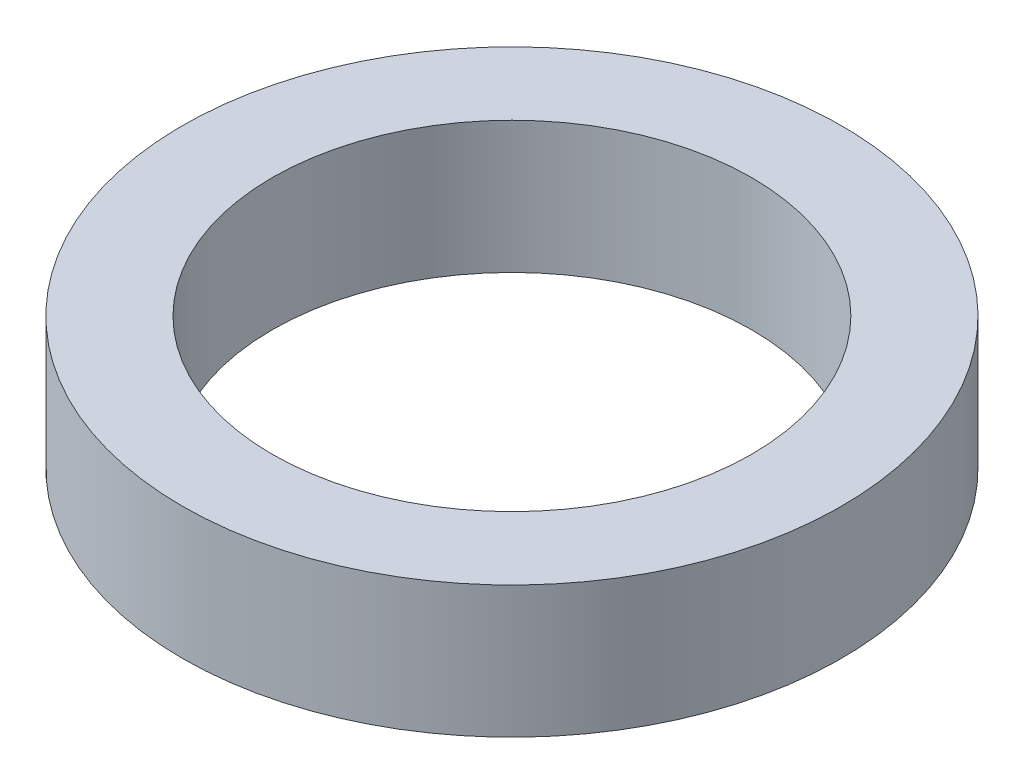
ISO-10303-21;
HEADER;
FILE_DESCRIPTION(('STEP AP214'),'2;1');
FILE_NAME('part.step','',(''),(''),'','','');
FILE_SCHEMA(('AUTOMOTIVE_DESIGN { 1 0 10303 214 1 1 1 1 }'));
ENDSEC;
DATA;
#1=APPLICATION_CONTEXT('core data for automotive mechanical design processes');
#2=APPLICATION_PROTOCOL_DEFINITION('international standard','automotive_design',2000,#1);
#3=PRODUCT_CONTEXT('',#1,'mechanical');
#4=PRODUCT('Part','Part','',(#3));
#5=PRODUCT_RELATED_PRODUCT_CATEGORY('part','',(#4));
#6=PRODUCT_DEFINITION_FORMATION('','',#4);
#7=PRODUCT_DEFINITION_CONTEXT('part definition',#1,'design');
#8=PRODUCT_DEFINITION('design','',#6,#7);
#9=PRODUCT_DEFINITION_SHAPE('','',#8);
#10=(LENGTH_UNIT() NAMED_UNIT(*) SI_UNIT(.MILLI.,.METRE.));
#11=(NAMED_UNIT(*) PLANE_ANGLE_UNIT() SI_UNIT($,.RADIAN.));
#12=(NAMED_UNIT(*) SI_UNIT($,.STERADIAN.) SOLID_ANGLE_UNIT());
#13=UNCERTAINTY_MEASURE_WITH_UNIT(LENGTH_MEASURE(1.E-05),#10,'distance_accuracy_value','');
#14=(GEOMETRIC_REPRESENTATION_CONTEXT(3) GLOBAL_UNCERTAINTY_ASSIGNED_CONTEXT((#13)) GLOBAL_UNIT_ASSIGNED_CONTEXT((#10,
#11,#12)) REPRESENTATION_CONTEXT('',''));
#15=CARTESIAN_POINT('',(0.,0.,0.));
#16=DIRECTION('',(0.,0.,1.));
#17=DIRECTION('',(1.,0.,0.));
#18=AXIS2_PLACEMENT_3D('',#15,#16,#17);
#19=CARTESIAN_POINT('',(0.,22.,0.));
#20=DIRECTION('',(0.,-1.,0.));
#21=DIRECTION('',(0.,0.,-1.));
#22=AXIS2_PLACEMENT_3D('',#19,#20,#21);
#23=CYLINDRICAL_SURFACE('',#22,55.);
#24=CARTESIAN_POINT('',(0.,22.,0.));
#25=DIRECTION('',(0.,1.,0.));
#26=DIRECTION('',(0.,0.,1.));
#27=AXIS2_PLACEMENT_3D('',#24,#25,#26);
#28=CIRCLE('',#27,55.);
#29=CARTESIAN_POINT('',(0.,22.,55.));
#30=VERTEX_POINT('',#29);
#31=EDGE_CURVE('E10',#30,#30,#28,.T.);
#32=ORIENTED_EDGE('',*,*,#31,.F.);
#33=EDGE_LOOP('',(#32));
#34=FACE_BOUND('',#33,.T.);
#35=CARTESIAN_POINT('',(0.,0.,0.));
#36=DIRECTION('',(0.,1.,0.));
#37=DIRECTION('',(0.,0.,1.));
#38=AXIS2_PLACEMENT_3D('',#35,#36,#37);
#39=CIRCLE('',#38,55.);
#40=CARTESIAN_POINT('',(0.,0.,55.));
#41=VERTEX_POINT('',#40);
#42=EDGE_CURVE('E37',#41,#41,#39,.T.);
#43=ORIENTED_EDGE('',*,*,#42,.T.);
#44=EDGE_LOOP('',(#43));
#45=FACE_BOUND('',#44,.T.);
#46=ADVANCED_FACE('F40',(#34,#45),#23,.T.);
#47=CARTESIAN_POINT('',(0.,22.,0.));
#48=DIRECTION('',(0.,1.,0.));
#49=DIRECTION('',(0.,0.,1.));
#50=AXIS2_PLACEMENT_3D('',#47,#48,#49);
#51=PLANE('',#50);
#52=CARTESIAN_POINT('',(0.,22.,0.));
#53=DIRECTION('',(0.,1.,0.));
#54=DIRECTION('',(0.,0.,1.));
#55=AXIS2_PLACEMENT_3D('',#52,#53,#54);
#56=CIRCLE('',#55,40.);
#57=CARTESIAN_POINT('',(0.,22.,40.));
#58=VERTEX_POINT('',#57);
#59=EDGE_CURVE('E50',#58,#58,#56,.T.);
#60=ORIENTED_EDGE('',*,*,#59,.F.);
#61=EDGE_LOOP('',(#60));
#62=FACE_BOUND('',#61,.T.);
#63=ORIENTED_EDGE('',*,*,#31,.T.);
#64=EDGE_LOOP('',(#63));
#65=FACE_BOUND('',#64,.T.);
#66=ADVANCED_FACE('F59',(#62,#65),#51,.T.);
#67=CARTESIAN_POINT('',(0.,0.,0.));
#68=DIRECTION('',(0.,1.,0.));
#69=DIRECTION('',(0.,0.,1.));
#70=AXIS2_PLACEMENT_3D('',#67,#68,#69);
#71=PLANE('',#70);
#72=CARTESIAN_POINT('',(0.,0.,0.));
#73=DIRECTION('',(0.,1.,0.));
#74=DIRECTION('',(0.,0.,1.));
#75=AXIS2_PLACEMENT_3D('',#72,#73,#74);
#76=CIRCLE('',#75,40.);
#77=CARTESIAN_POINT('',(0.,0.,40.));
#78=VERTEX_POINT('',#77);
#79=EDGE_CURVE('E47',#78,#78,#76,.T.);
#80=ORIENTED_EDGE('',*,*,#79,.T.);
#81=EDGE_LOOP('',(#80));
#82=FACE_BOUND('',#81,.T.);
#83=ORIENTED_EDGE('',*,*,#42,.F.);
#84=EDGE_LOOP('',(#83));
#85=FACE_BOUND('',#84,.T.);
#86=ADVANCED_FACE('F58',(#82,#85),#71,.F.);
#87=CARTESIAN_POINT('',(0.,22.,0.));
#88=DIRECTION('',(0.,-1.,0.));
#89=DIRECTION('',(0.,0.,-1.));
#90=AXIS2_PLACEMENT_3D('',#87,#88,#89);
#91=CYLINDRICAL_SURFACE('',#90,40.);
#92=ORIENTED_EDGE('',*,*,#59,.T.);
#93=EDGE_LOOP('',(#92));
#94=FACE_BOUND('',#93,.T.);
#95=ORIENTED_EDGE('',*,*,#79,.F.);
#96=EDGE_LOOP('',(#95));
#97=FACE_BOUND('',#96,.T.);
#98=ADVANCED_FACE('F54',(#94,#97),#91,.F.);
#99=CLOSED_SHELL('',(#46,#66,#86,#98));
#100=MANIFOLD_SOLID_BREP('B2',#99);
#101=ADVANCED_BREP_SHAPE_REPRESENTATION('',(#18,#100),#14);
#102=SHAPE_DEFINITION_REPRESENTATION(#9,#101);
ENDSEC;
END-ISO-10303-21;
